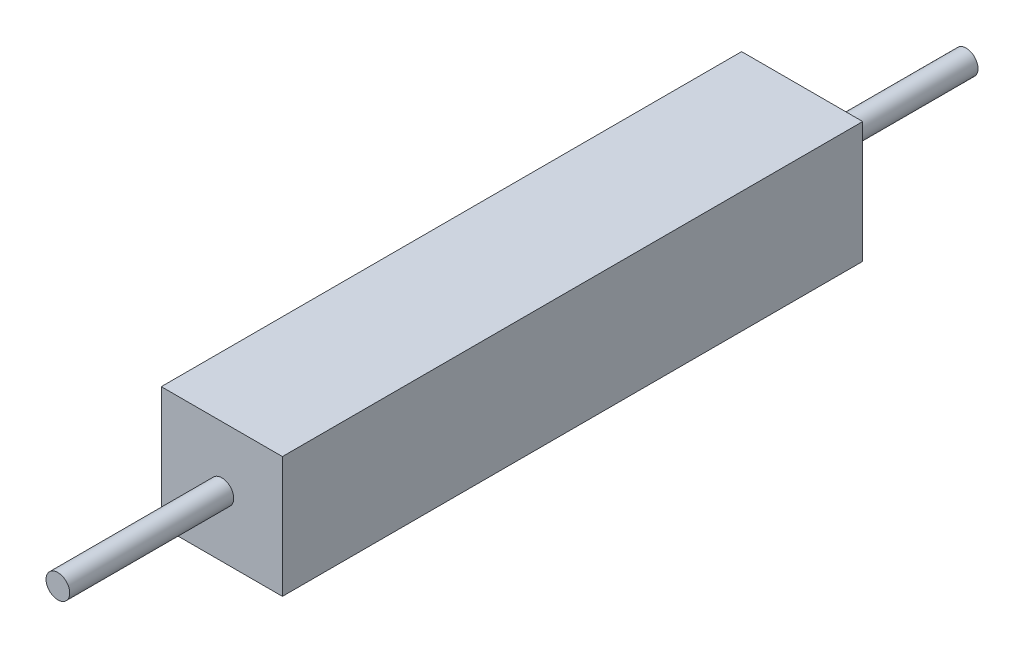
ISO-10303-21;
HEADER;
FILE_DESCRIPTION(('STEP AP214'),'2;1');
FILE_NAME('part.step','',(''),(''),'','','');
FILE_SCHEMA(('AUTOMOTIVE_DESIGN { 1 0 10303 214 1 1 1 1 }'));
ENDSEC;
DATA;
#1=APPLICATION_CONTEXT('core data for automotive mechanical design processes');
#2=APPLICATION_PROTOCOL_DEFINITION('international standard','automotive_design',2000,#1);
#3=PRODUCT_CONTEXT('',#1,'mechanical');
#4=PRODUCT('Part','Part','',(#3));
#5=PRODUCT_RELATED_PRODUCT_CATEGORY('part','',(#4));
#6=PRODUCT_DEFINITION_FORMATION('','',#4);
#7=PRODUCT_DEFINITION_CONTEXT('part definition',#1,'design');
#8=PRODUCT_DEFINITION('design','',#6,#7);
#9=PRODUCT_DEFINITION_SHAPE('','',#8);
#10=(LENGTH_UNIT() NAMED_UNIT(*) SI_UNIT(.MILLI.,.METRE.));
#11=(NAMED_UNIT(*) PLANE_ANGLE_UNIT() SI_UNIT($,.RADIAN.));
#12=(NAMED_UNIT(*) SI_UNIT($,.STERADIAN.) SOLID_ANGLE_UNIT());
#13=UNCERTAINTY_MEASURE_WITH_UNIT(LENGTH_MEASURE(1.E-05),#10,'distance_accuracy_value','');
#14=(GEOMETRIC_REPRESENTATION_CONTEXT(3) GLOBAL_UNCERTAINTY_ASSIGNED_CONTEXT((#13)) GLOBAL_UNIT_ASSIGNED_CONTEXT((#10,
#11,#12)) REPRESENTATION_CONTEXT('',''));
#15=CARTESIAN_POINT('',(0.,0.,0.));
#16=DIRECTION('',(0.,0.,1.));
#17=DIRECTION('',(1.,0.,0.));
#18=AXIS2_PLACEMENT_3D('',#15,#16,#17);
#19=CARTESIAN_POINT('',(0.,0.,11.5));
#20=DIRECTION('',(1.,0.,0.));
#21=DIRECTION('',(0.,0.,-1.));
#22=AXIS2_PLACEMENT_3D('',#19,#20,#21);
#23=PLANE('',#22);
#24=DIRECTION('',(0.,-1.,0.));
#25=VECTOR('',#24,1.);
#26=CARTESIAN_POINT('',(0.,0.,0.));
#27=LINE('',#26,#25);
#28=CARTESIAN_POINT('',(0.,2.4,0.));
#29=VERTEX_POINT('',#28);
#30=CARTESIAN_POINT('',(0.,0.,0.));
#31=VERTEX_POINT('',#30);
#32=EDGE_CURVE('E98',#29,#31,#27,.T.);
#33=ORIENTED_EDGE('',*,*,#32,.T.);
#34=DIRECTION('',(0.,0.,-1.));
#35=VECTOR('',#34,1.);
#36=CARTESIAN_POINT('',(0.,0.,11.5));
#37=LINE('',#36,#35);
#38=CARTESIAN_POINT('',(0.,0.,11.5));
#39=VERTEX_POINT('',#38);
#40=EDGE_CURVE('E40',#39,#31,#37,.T.);
#41=ORIENTED_EDGE('',*,*,#40,.F.);
#42=DIRECTION('',(0.,-1.,0.));
#43=VECTOR('',#42,1.);
#44=CARTESIAN_POINT('',(0.,0.,11.5));
#45=LINE('',#44,#43);
#46=CARTESIAN_POINT('',(0.,2.4,11.5));
#47=VERTEX_POINT('',#46);
#48=EDGE_CURVE('E84',#47,#39,#45,.T.);
#49=ORIENTED_EDGE('',*,*,#48,.F.);
#50=DIRECTION('',(0.,0.,-1.));
#51=VECTOR('',#50,1.);
#52=CARTESIAN_POINT('',(0.,2.4,11.5));
#53=LINE('',#52,#51);
#54=EDGE_CURVE('E94',#47,#29,#53,.T.);
#55=ORIENTED_EDGE('',*,*,#54,.T.);
#56=EDGE_LOOP('',(#33,#41,#49,#55));
#57=FACE_BOUND('',#56,.T.);
#58=ADVANCED_FACE('F32',(#57),#23,.F.);
#59=CARTESIAN_POINT('',(0.,0.,11.5));
#60=DIRECTION('',(0.,1.,0.));
#61=DIRECTION('',(0.,0.,1.));
#62=AXIS2_PLACEMENT_3D('',#59,#60,#61);
#63=PLANE('',#62);
#64=DIRECTION('',(1.,0.,0.));
#65=VECTOR('',#64,1.);
#66=CARTESIAN_POINT('',(0.,0.,0.));
#67=LINE('',#66,#65);
#68=CARTESIAN_POINT('',(2.4,0.,0.));
#69=VERTEX_POINT('',#68);
#70=EDGE_CURVE('E89',#31,#69,#67,.T.);
#71=ORIENTED_EDGE('',*,*,#70,.T.);
#72=DIRECTION('',(0.,0.,-1.));
#73=VECTOR('',#72,1.);
#74=CARTESIAN_POINT('',(2.4,0.,11.5));
#75=LINE('',#74,#73);
#76=CARTESIAN_POINT('',(2.4,0.,11.5));
#77=VERTEX_POINT('',#76);
#78=EDGE_CURVE('E87',#77,#69,#75,.T.);
#79=ORIENTED_EDGE('',*,*,#78,.F.);
#80=DIRECTION('',(1.,0.,0.));
#81=VECTOR('',#80,1.);
#82=CARTESIAN_POINT('',(0.,0.,11.5));
#83=LINE('',#82,#81);
#84=EDGE_CURVE('E79',#39,#77,#83,.T.);
#85=ORIENTED_EDGE('',*,*,#84,.F.);
#86=ORIENTED_EDGE('',*,*,#40,.T.);
#87=EDGE_LOOP('',(#71,#79,#85,#86));
#88=FACE_BOUND('',#87,.T.);
#89=ADVANCED_FACE('F88',(#88),#63,.F.);
#90=CARTESIAN_POINT('',(2.4,0.,11.5));
#91=DIRECTION('',(-1.,0.,0.));
#92=DIRECTION('',(0.,0.,1.));
#93=AXIS2_PLACEMENT_3D('',#90,#91,#92);
#94=PLANE('',#93);
#95=DIRECTION('',(0.,1.,0.));
#96=VECTOR('',#95,1.);
#97=CARTESIAN_POINT('',(2.4,0.,0.));
#98=LINE('',#97,#96);
#99=CARTESIAN_POINT('',(2.4,2.4,0.));
#100=VERTEX_POINT('',#99);
#101=EDGE_CURVE('E65',#69,#100,#98,.T.);
#102=ORIENTED_EDGE('',*,*,#101,.T.);
#103=DIRECTION('',(0.,0.,-1.));
#104=VECTOR('',#103,1.);
#105=CARTESIAN_POINT('',(2.4,2.4,11.5));
#106=LINE('',#105,#104);
#107=CARTESIAN_POINT('',(2.4,2.4,11.5));
#108=VERTEX_POINT('',#107);
#109=EDGE_CURVE('E90',#108,#100,#106,.T.);
#110=ORIENTED_EDGE('',*,*,#109,.F.);
#111=DIRECTION('',(0.,1.,0.));
#112=VECTOR('',#111,1.);
#113=CARTESIAN_POINT('',(2.4,0.,11.5));
#114=LINE('',#113,#112);
#115=EDGE_CURVE('E82',#77,#108,#114,.T.);
#116=ORIENTED_EDGE('',*,*,#115,.F.);
#117=ORIENTED_EDGE('',*,*,#78,.T.);
#118=EDGE_LOOP('',(#102,#110,#116,#117));
#119=FACE_BOUND('',#118,.T.);
#120=ADVANCED_FACE('F92',(#119),#94,.F.);
#121=CARTESIAN_POINT('',(0.,2.4,11.5));
#122=DIRECTION('',(0.,-1.,0.));
#123=DIRECTION('',(0.,0.,-1.));
#124=AXIS2_PLACEMENT_3D('',#121,#122,#123);
#125=PLANE('',#124);
#126=DIRECTION('',(-1.,0.,0.));
#127=VECTOR('',#126,1.);
#128=CARTESIAN_POINT('',(0.,2.4,0.));
#129=LINE('',#128,#127);
#130=EDGE_CURVE('E71',#100,#29,#129,.T.);
#131=ORIENTED_EDGE('',*,*,#130,.T.);
#132=ORIENTED_EDGE('',*,*,#54,.F.);
#133=DIRECTION('',(-1.,0.,0.));
#134=VECTOR('',#133,1.);
#135=CARTESIAN_POINT('',(0.,2.4,11.5));
#136=LINE('',#135,#134);
#137=EDGE_CURVE('E48',#108,#47,#136,.T.);
#138=ORIENTED_EDGE('',*,*,#137,.F.);
#139=ORIENTED_EDGE('',*,*,#109,.T.);
#140=EDGE_LOOP('',(#131,#132,#138,#139));
#141=FACE_BOUND('',#140,.T.);
#142=ADVANCED_FACE('F121',(#141),#125,.F.);
#143=CARTESIAN_POINT('',(0.,0.,11.5));
#144=DIRECTION('',(0.,0.,-1.));
#145=DIRECTION('',(-1.,0.,0.));
#146=AXIS2_PLACEMENT_3D('',#143,#144,#145);
#147=PLANE('',#146);
#148=CARTESIAN_POINT('',(1.2,1.2,11.5));
#149=DIRECTION('',(0.,0.,-1.));
#150=DIRECTION('',(-1.,0.,0.));
#151=AXIS2_PLACEMENT_3D('',#148,#149,#150);
#152=CIRCLE('',#151,0.235);
#153=CARTESIAN_POINT('',(0.965,1.2,11.5));
#154=VERTEX_POINT('',#153);
#155=EDGE_CURVE('E11',#154,#154,#152,.F.);
#156=ORIENTED_EDGE('',*,*,#155,.F.);
#157=EDGE_LOOP('',(#156));
#158=FACE_BOUND('',#157,.T.);
#159=ORIENTED_EDGE('',*,*,#48,.T.);
#160=ORIENTED_EDGE('',*,*,#84,.T.);
#161=ORIENTED_EDGE('',*,*,#115,.T.);
#162=ORIENTED_EDGE('',*,*,#137,.T.);
#163=EDGE_LOOP('',(#159,#160,#161,#162));
#164=FACE_BOUND('',#163,.T.);
#165=ADVANCED_FACE('F80',(#158,#164),#147,.F.);
#166=CARTESIAN_POINT('',(0.,0.,0.));
#167=DIRECTION('',(0.,0.,-1.));
#168=DIRECTION('',(-1.,0.,0.));
#169=AXIS2_PLACEMENT_3D('',#166,#167,#168);
#170=PLANE('',#169);
#171=CARTESIAN_POINT('',(1.2,1.2,0.));
#172=DIRECTION('',(0.,0.,-1.));
#173=DIRECTION('',(-1.,0.,0.));
#174=AXIS2_PLACEMENT_3D('',#171,#172,#173);
#175=CIRCLE('',#174,0.235);
#176=CARTESIAN_POINT('',(0.965,1.2,0.));
#177=VERTEX_POINT('',#176);
#178=EDGE_CURVE('E189',#177,#177,#175,.T.);
#179=ORIENTED_EDGE('',*,*,#178,.F.);
#180=EDGE_LOOP('',(#179));
#181=FACE_BOUND('',#180,.T.);
#182=ORIENTED_EDGE('',*,*,#32,.F.);
#183=ORIENTED_EDGE('',*,*,#130,.F.);
#184=ORIENTED_EDGE('',*,*,#101,.F.);
#185=ORIENTED_EDGE('',*,*,#70,.F.);
#186=EDGE_LOOP('',(#182,#183,#184,#185));
#187=FACE_BOUND('',#186,.T.);
#188=ADVANCED_FACE('F109',(#181,#187),#170,.T.);
#189=CARTESIAN_POINT('',(1.2,1.2,14.75));
#190=DIRECTION('',(0.,0.,-1.));
#191=DIRECTION('',(-1.,0.,0.));
#192=AXIS2_PLACEMENT_3D('',#189,#190,#191);
#193=CYLINDRICAL_SURFACE('',#192,0.235);
#194=CARTESIAN_POINT('',(1.2,1.2,14.75));
#195=DIRECTION('',(0.,0.,1.));
#196=DIRECTION('',(1.,0.,0.));
#197=AXIS2_PLACEMENT_3D('',#194,#195,#196);
#198=CIRCLE('',#197,0.235);
#199=CARTESIAN_POINT('',(1.435,1.2,14.75));
#200=VERTEX_POINT('',#199);
#201=EDGE_CURVE('E101',#200,#200,#198,.T.);
#202=ORIENTED_EDGE('',*,*,#201,.F.);
#203=EDGE_LOOP('',(#202));
#204=FACE_BOUND('',#203,.T.);
#205=ORIENTED_EDGE('',*,*,#155,.T.);
#206=EDGE_LOOP('',(#205));
#207=FACE_BOUND('',#206,.T.);
#208=ADVANCED_FACE('F111',(#204,#207),#193,.T.);
#209=CARTESIAN_POINT('',(1.2,1.2,14.75));
#210=DIRECTION('',(0.,0.,1.));
#211=DIRECTION('',(1.,0.,0.));
#212=AXIS2_PLACEMENT_3D('',#209,#210,#211);
#213=PLANE('',#212);
#214=ORIENTED_EDGE('',*,*,#201,.T.);
#215=EDGE_LOOP('',(#214));
#216=FACE_BOUND('',#215,.T.);
#217=ADVANCED_FACE('F118',(#216),#213,.T.);
#218=CARTESIAN_POINT('',(1.2,1.2,-3.25));
#219=DIRECTION('',(0.,0.,1.));
#220=DIRECTION('',(1.,0.,0.));
#221=AXIS2_PLACEMENT_3D('',#218,#219,#220);
#222=CYLINDRICAL_SURFACE('',#221,0.235);
#223=CARTESIAN_POINT('',(1.2,1.2,-3.25));
#224=DIRECTION('',(0.,0.,-1.));
#225=DIRECTION('',(-1.,0.,0.));
#226=AXIS2_PLACEMENT_3D('',#223,#224,#225);
#227=CIRCLE('',#226,0.235);
#228=CARTESIAN_POINT('',(0.965,1.2,-3.25));
#229=VERTEX_POINT('',#228);
#230=EDGE_CURVE('E188',#229,#229,#227,.T.);
#231=ORIENTED_EDGE('',*,*,#230,.F.);
#232=EDGE_LOOP('',(#231));
#233=FACE_BOUND('',#232,.T.);
#234=ORIENTED_EDGE('',*,*,#178,.T.);
#235=EDGE_LOOP('',(#234));
#236=FACE_BOUND('',#235,.T.);
#237=ADVANCED_FACE('F158',(#233,#236),#222,.T.);
#238=CARTESIAN_POINT('',(1.2,1.2,-3.25));
#239=DIRECTION('',(0.,0.,-1.));
#240=DIRECTION('',(-1.,0.,0.));
#241=AXIS2_PLACEMENT_3D('',#238,#239,#240);
#242=PLANE('',#241);
#243=ORIENTED_EDGE('',*,*,#230,.T.);
#244=EDGE_LOOP('',(#243));
#245=FACE_BOUND('',#244,.T.);
#246=ADVANCED_FACE('F172',(#245),#242,.T.);
#247=CLOSED_SHELL('',(#58,#89,#120,#142,#165,#188,#208,#217,#237,#246));
#248=MANIFOLD_SOLID_BREP('B2',#247);
#249=ADVANCED_BREP_SHAPE_REPRESENTATION('',(#18,#248),#14);
#250=SHAPE_DEFINITION_REPRESENTATION(#9,#249);
ENDSEC;
END-ISO-10303-21;
